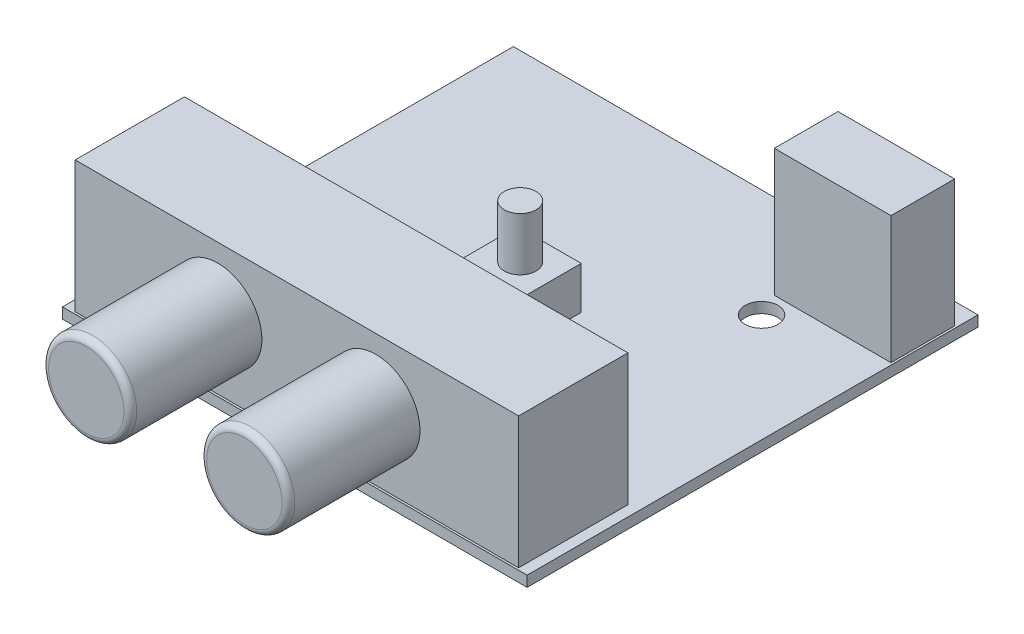
ISO-10303-21;
HEADER;
FILE_DESCRIPTION(('STEP AP214'),'2;1');
FILE_NAME('part.step','',(''),(''),'','','');
FILE_SCHEMA(('AUTOMOTIVE_DESIGN { 1 0 10303 214 1 1 1 1 }'));
ENDSEC;
DATA;
#1=APPLICATION_CONTEXT('core data for automotive mechanical design processes');
#2=APPLICATION_PROTOCOL_DEFINITION('international standard','automotive_design',2000,#1);
#3=PRODUCT_CONTEXT('',#1,'mechanical');
#4=PRODUCT('Part','Part','',(#3));
#5=PRODUCT_RELATED_PRODUCT_CATEGORY('part','',(#4));
#6=PRODUCT_DEFINITION_FORMATION('','',#4);
#7=PRODUCT_DEFINITION_CONTEXT('part definition',#1,'design');
#8=PRODUCT_DEFINITION('design','',#6,#7);
#9=PRODUCT_DEFINITION_SHAPE('','',#8);
#10=(LENGTH_UNIT() NAMED_UNIT(*) SI_UNIT(.MILLI.,.METRE.));
#11=(NAMED_UNIT(*) PLANE_ANGLE_UNIT() SI_UNIT($,.RADIAN.));
#12=(NAMED_UNIT(*) SI_UNIT($,.STERADIAN.) SOLID_ANGLE_UNIT());
#13=UNCERTAINTY_MEASURE_WITH_UNIT(LENGTH_MEASURE(1.E-05),#10,'distance_accuracy_value','');
#14=(GEOMETRIC_REPRESENTATION_CONTEXT(3) GLOBAL_UNCERTAINTY_ASSIGNED_CONTEXT((#13)) GLOBAL_UNIT_ASSIGNED_CONTEXT((#10,
#11,#12)) REPRESENTATION_CONTEXT('',''));
#15=CARTESIAN_POINT('',(0.,0.,0.));
#16=DIRECTION('',(0.,0.,1.));
#17=DIRECTION('',(1.,0.,0.));
#18=AXIS2_PLACEMENT_3D('',#15,#16,#17);
#19=CARTESIAN_POINT('',(0.,1.,0.));
#20=DIRECTION('',(0.,1.,0.));
#21=DIRECTION('',(0.,0.,1.));
#22=AXIS2_PLACEMENT_3D('',#19,#20,#21);
#23=PLANE('',#22);
#24=CARTESIAN_POINT('',(11.7,1.,-11.05));
#25=DIRECTION('',(0.,1.,0.));
#26=DIRECTION('',(0.,0.,1.));
#27=AXIS2_PLACEMENT_3D('',#24,#25,#26);
#28=CIRCLE('',#27,1.55);
#29=CARTESIAN_POINT('',(11.7,1.,-9.5));
#30=VERTEX_POINT('',#29);
#31=EDGE_CURVE('E364',#30,#30,#28,.T.);
#32=ORIENTED_EDGE('',*,*,#31,.F.);
#33=EDGE_LOOP('',(#32));
#34=FACE_BOUND('',#33,.T.);
#35=DIRECTION('',(0.,0.,1.));
#36=VECTOR('',#35,1.);
#37=CARTESIAN_POINT('',(-21.9,1.,21.25));
#38=LINE('',#37,#36);
#39=CARTESIAN_POINT('',(-21.9,1.,-21.25));
#40=VERTEX_POINT('',#39);
#41=CARTESIAN_POINT('',(-21.9,1.,21.25));
#42=VERTEX_POINT('',#41);
#43=EDGE_CURVE('E237',#40,#42,#38,.T.);
#44=ORIENTED_EDGE('',*,*,#43,.T.);
#45=DIRECTION('',(1.,0.,0.));
#46=VECTOR('',#45,1.);
#47=CARTESIAN_POINT('',(21.9,1.,21.25));
#48=LINE('',#47,#46);
#49=CARTESIAN_POINT('',(21.9,1.,21.25));
#50=VERTEX_POINT('',#49);
#51=EDGE_CURVE('E240',#42,#50,#48,.T.);
#52=ORIENTED_EDGE('',*,*,#51,.T.);
#53=DIRECTION('',(0.,0.,-1.));
#54=VECTOR('',#53,1.);
#55=CARTESIAN_POINT('',(21.9,1.,21.25));
#56=LINE('',#55,#54);
#57=CARTESIAN_POINT('',(21.9,1.,-21.25));
#58=VERTEX_POINT('',#57);
#59=EDGE_CURVE('E243',#50,#58,#56,.T.);
#60=ORIENTED_EDGE('',*,*,#59,.T.);
#61=DIRECTION('',(-1.,0.,0.));
#62=VECTOR('',#61,1.);
#63=CARTESIAN_POINT('',(21.9,1.,-21.25));
#64=LINE('',#63,#62);
#65=EDGE_CURVE('E245',#58,#40,#64,.T.);
#66=ORIENTED_EDGE('',*,*,#65,.T.);
#67=EDGE_LOOP('',(#44,#52,#60,#66));
#68=FACE_BOUND('',#67,.T.);
#69=DIRECTION('',(1.,0.,0.));
#70=VECTOR('',#69,1.);
#71=CARTESIAN_POINT('',(-20.9,1.,21.05));
#72=LINE('',#71,#70);
#73=CARTESIAN_POINT('',(-20.9,1.,21.05));
#74=VERTEX_POINT('',#73);
#75=CARTESIAN_POINT('',(20.9,1.,21.05));
#76=VERTEX_POINT('',#75);
#77=EDGE_CURVE('E221',#74,#76,#72,.T.);
#78=ORIENTED_EDGE('',*,*,#77,.F.);
#79=DIRECTION('',(0.,0.,1.));
#80=VECTOR('',#79,1.);
#81=CARTESIAN_POINT('',(-20.9,1.,10.75));
#82=LINE('',#81,#80);
#83=CARTESIAN_POINT('',(-20.9,1.,10.75));
#84=VERTEX_POINT('',#83);
#85=EDGE_CURVE('E207',#84,#74,#82,.T.);
#86=ORIENTED_EDGE('',*,*,#85,.F.);
#87=DIRECTION('',(-1.,0.,0.));
#88=VECTOR('',#87,1.);
#89=CARTESIAN_POINT('',(-20.9,1.,10.75));
#90=LINE('',#89,#88);
#91=CARTESIAN_POINT('',(20.9,1.,10.75));
#92=VERTEX_POINT('',#91);
#93=EDGE_CURVE('E212',#92,#84,#90,.T.);
#94=ORIENTED_EDGE('',*,*,#93,.F.);
#95=DIRECTION('',(0.,0.,-1.));
#96=VECTOR('',#95,1.);
#97=CARTESIAN_POINT('',(20.9,1.,10.75));
#98=LINE('',#97,#96);
#99=EDGE_CURVE('E223',#76,#92,#98,.T.);
#100=ORIENTED_EDGE('',*,*,#99,.F.);
#101=EDGE_LOOP('',(#78,#86,#94,#100));
#102=FACE_BOUND('',#101,.T.);
#103=DIRECTION('',(1.,0.,0.));
#104=VECTOR('',#103,1.);
#105=CARTESIAN_POINT('',(10.7,1.,-13.25));
#106=LINE('',#105,#104);
#107=CARTESIAN_POINT('',(10.7,1.,-13.25));
#108=VERTEX_POINT('',#107);
#109=CARTESIAN_POINT('',(21.7,1.,-13.25));
#110=VERTEX_POINT('',#109);
#111=EDGE_CURVE('E179',#108,#110,#106,.T.);
#112=ORIENTED_EDGE('',*,*,#111,.F.);
#113=DIRECTION('',(0.,0.,1.));
#114=VECTOR('',#113,1.);
#115=CARTESIAN_POINT('',(10.7,1.,-13.25));
#116=LINE('',#115,#114);
#117=CARTESIAN_POINT('',(10.7,1.,-19.25));
#118=VERTEX_POINT('',#117);
#119=EDGE_CURVE('E176',#118,#108,#116,.T.);
#120=ORIENTED_EDGE('',*,*,#119,.F.);
#121=DIRECTION('',(-1.,0.,0.));
#122=VECTOR('',#121,1.);
#123=CARTESIAN_POINT('',(10.7,1.,-19.25));
#124=LINE('',#123,#122);
#125=CARTESIAN_POINT('',(21.7,1.,-19.25));
#126=VERTEX_POINT('',#125);
#127=EDGE_CURVE('E188',#126,#118,#124,.T.);
#128=ORIENTED_EDGE('',*,*,#127,.F.);
#129=DIRECTION('',(0.,0.,-1.));
#130=VECTOR('',#129,1.);
#131=CARTESIAN_POINT('',(21.7,1.,-13.25));
#132=LINE('',#131,#130);
#133=EDGE_CURVE('E196',#110,#126,#132,.T.);
#134=ORIENTED_EDGE('',*,*,#133,.F.);
#135=EDGE_LOOP('',(#112,#120,#128,#134));
#136=FACE_BOUND('',#135,.T.);
#137=DIRECTION('',(1.,0.,0.));
#138=VECTOR('',#137,1.);
#139=CARTESIAN_POINT('',(-3.,1.,3.25));
#140=LINE('',#139,#138);
#141=CARTESIAN_POINT('',(-3.,1.,3.25));
#142=VERTEX_POINT('',#141);
#143=CARTESIAN_POINT('',(3.,1.,3.25));
#144=VERTEX_POINT('',#143);
#145=EDGE_CURVE('E346',#142,#144,#140,.T.);
#146=ORIENTED_EDGE('',*,*,#145,.F.);
#147=DIRECTION('',(0.,0.,1.));
#148=VECTOR('',#147,1.);
#149=CARTESIAN_POINT('',(-3.,1.,-2.75));
#150=LINE('',#149,#148);
#151=CARTESIAN_POINT('',(-3.,1.,-2.75));
#152=VERTEX_POINT('',#151);
#153=EDGE_CURVE('E174',#152,#142,#150,.T.);
#154=ORIENTED_EDGE('',*,*,#153,.F.);
#155=DIRECTION('',(-1.,0.,0.));
#156=VECTOR('',#155,1.);
#157=CARTESIAN_POINT('',(-3.,1.,-2.75));
#158=LINE('',#157,#156);
#159=CARTESIAN_POINT('',(3.,1.,-2.75));
#160=VERTEX_POINT('',#159);
#161=EDGE_CURVE('E170',#160,#152,#158,.T.);
#162=ORIENTED_EDGE('',*,*,#161,.F.);
#163=DIRECTION('',(0.,0.,-1.));
#164=VECTOR('',#163,1.);
#165=CARTESIAN_POINT('',(3.,1.,-2.75));
#166=LINE('',#165,#164);
#167=EDGE_CURVE('E348',#144,#160,#166,.T.);
#168=ORIENTED_EDGE('',*,*,#167,.F.);
#169=EDGE_LOOP('',(#146,#154,#162,#168));
#170=FACE_BOUND('',#169,.T.);
#171=ADVANCED_FACE('F37',(#34,#68,#102,#136,#170),#23,.T.);
#172=CARTESIAN_POINT('',(-21.9,1.,21.25));
#173=DIRECTION('',(1.,0.,0.));
#174=DIRECTION('',(0.,0.,-1.));
#175=AXIS2_PLACEMENT_3D('',#172,#173,#174);
#176=PLANE('',#175);
#177=DIRECTION('',(0.,0.,1.));
#178=VECTOR('',#177,1.);
#179=CARTESIAN_POINT('',(-21.9,0.,21.25));
#180=LINE('',#179,#178);
#181=CARTESIAN_POINT('',(-21.9,0.,-21.25));
#182=VERTEX_POINT('',#181);
#183=CARTESIAN_POINT('',(-21.9,0.,21.25));
#184=VERTEX_POINT('',#183);
#185=EDGE_CURVE('E236',#182,#184,#180,.T.);
#186=ORIENTED_EDGE('',*,*,#185,.T.);
#187=DIRECTION('',(0.,-1.,0.));
#188=VECTOR('',#187,1.);
#189=CARTESIAN_POINT('',(-21.9,1.,21.25));
#190=LINE('',#189,#188);
#191=EDGE_CURVE('E263',#42,#184,#190,.T.);
#192=ORIENTED_EDGE('',*,*,#191,.F.);
#193=ORIENTED_EDGE('',*,*,#43,.F.);
#194=DIRECTION('',(0.,-1.,0.));
#195=VECTOR('',#194,1.);
#196=CARTESIAN_POINT('',(-21.9,1.,-21.25));
#197=LINE('',#196,#195);
#198=EDGE_CURVE('E247',#40,#182,#197,.T.);
#199=ORIENTED_EDGE('',*,*,#198,.T.);
#200=EDGE_LOOP('',(#186,#192,#193,#199));
#201=FACE_BOUND('',#200,.T.);
#202=ADVANCED_FACE('F293',(#201),#176,.F.);
#203=CARTESIAN_POINT('',(21.9,1.,21.25));
#204=DIRECTION('',(0.,0.,-1.));
#205=DIRECTION('',(-1.,0.,0.));
#206=AXIS2_PLACEMENT_3D('',#203,#204,#205);
#207=PLANE('',#206);
#208=DIRECTION('',(1.,0.,0.));
#209=VECTOR('',#208,1.);
#210=CARTESIAN_POINT('',(21.9,0.,21.25));
#211=LINE('',#210,#209);
#212=CARTESIAN_POINT('',(21.9,0.,21.25));
#213=VERTEX_POINT('',#212);
#214=EDGE_CURVE('E250',#184,#213,#211,.T.);
#215=ORIENTED_EDGE('',*,*,#214,.T.);
#216=DIRECTION('',(0.,-1.,0.));
#217=VECTOR('',#216,1.);
#218=CARTESIAN_POINT('',(21.9,1.,21.25));
#219=LINE('',#218,#217);
#220=EDGE_CURVE('E260',#50,#213,#219,.T.);
#221=ORIENTED_EDGE('',*,*,#220,.F.);
#222=ORIENTED_EDGE('',*,*,#51,.F.);
#223=ORIENTED_EDGE('',*,*,#191,.T.);
#224=EDGE_LOOP('',(#215,#221,#222,#223));
#225=FACE_BOUND('',#224,.T.);
#226=ADVANCED_FACE('F301',(#225),#207,.F.);
#227=CARTESIAN_POINT('',(21.9,1.,21.25));
#228=DIRECTION('',(-1.,0.,0.));
#229=DIRECTION('',(0.,0.,1.));
#230=AXIS2_PLACEMENT_3D('',#227,#228,#229);
#231=PLANE('',#230);
#232=DIRECTION('',(0.,0.,-1.));
#233=VECTOR('',#232,1.);
#234=CARTESIAN_POINT('',(21.9,0.,21.25));
#235=LINE('',#234,#233);
#236=CARTESIAN_POINT('',(21.9,0.,-21.25));
#237=VERTEX_POINT('',#236);
#238=EDGE_CURVE('E252',#213,#237,#235,.T.);
#239=ORIENTED_EDGE('',*,*,#238,.T.);
#240=DIRECTION('',(0.,-1.,0.));
#241=VECTOR('',#240,1.);
#242=CARTESIAN_POINT('',(21.9,1.,-21.25));
#243=LINE('',#242,#241);
#244=EDGE_CURVE('E257',#58,#237,#243,.T.);
#245=ORIENTED_EDGE('',*,*,#244,.F.);
#246=ORIENTED_EDGE('',*,*,#59,.F.);
#247=ORIENTED_EDGE('',*,*,#220,.T.);
#248=EDGE_LOOP('',(#239,#245,#246,#247));
#249=FACE_BOUND('',#248,.T.);
#250=ADVANCED_FACE('F316',(#249),#231,.F.);
#251=CARTESIAN_POINT('',(21.9,1.,-21.25));
#252=DIRECTION('',(0.,0.,1.));
#253=DIRECTION('',(1.,0.,0.));
#254=AXIS2_PLACEMENT_3D('',#251,#252,#253);
#255=PLANE('',#254);
#256=DIRECTION('',(-1.,0.,0.));
#257=VECTOR('',#256,1.);
#258=CARTESIAN_POINT('',(21.9,0.,-21.25));
#259=LINE('',#258,#257);
#260=EDGE_CURVE('E241',#237,#182,#259,.T.);
#261=ORIENTED_EDGE('',*,*,#260,.T.);
#262=ORIENTED_EDGE('',*,*,#198,.F.);
#263=ORIENTED_EDGE('',*,*,#65,.F.);
#264=ORIENTED_EDGE('',*,*,#244,.T.);
#265=EDGE_LOOP('',(#261,#262,#263,#264));
#266=FACE_BOUND('',#265,.T.);
#267=ADVANCED_FACE('F312',(#266),#255,.F.);
#268=CARTESIAN_POINT('',(0.,0.,0.));
#269=DIRECTION('',(0.,1.,0.));
#270=DIRECTION('',(0.,0.,1.));
#271=AXIS2_PLACEMENT_3D('',#268,#269,#270);
#272=PLANE('',#271);
#273=CARTESIAN_POINT('',(11.7,0.,-11.05));
#274=DIRECTION('',(0.,1.,0.));
#275=DIRECTION('',(0.,0.,1.));
#276=AXIS2_PLACEMENT_3D('',#273,#274,#275);
#277=CIRCLE('',#276,1.55);
#278=CARTESIAN_POINT('',(11.7,0.,-9.5));
#279=VERTEX_POINT('',#278);
#280=EDGE_CURVE('E361',#279,#279,#277,.T.);
#281=ORIENTED_EDGE('',*,*,#280,.T.);
#282=EDGE_LOOP('',(#281));
#283=FACE_BOUND('',#282,.T.);
#284=ORIENTED_EDGE('',*,*,#185,.F.);
#285=ORIENTED_EDGE('',*,*,#260,.F.);
#286=ORIENTED_EDGE('',*,*,#238,.F.);
#287=ORIENTED_EDGE('',*,*,#214,.F.);
#288=EDGE_LOOP('',(#284,#285,#286,#287));
#289=FACE_BOUND('',#288,.T.);
#290=ADVANCED_FACE('F310',(#283,#289),#272,.F.);
#291=CARTESIAN_POINT('',(-20.9,13.4,10.75));
#292=DIRECTION('',(1.,0.,0.));
#293=DIRECTION('',(0.,0.,-1.));
#294=AXIS2_PLACEMENT_3D('',#291,#292,#293);
#295=PLANE('',#294);
#296=ORIENTED_EDGE('',*,*,#85,.T.);
#297=DIRECTION('',(0.,-1.,0.));
#298=VECTOR('',#297,1.);
#299=CARTESIAN_POINT('',(-20.9,13.4,21.05));
#300=LINE('',#299,#298);
#301=CARTESIAN_POINT('',(-20.9,13.4,21.05));
#302=VERTEX_POINT('',#301);
#303=EDGE_CURVE('E234',#302,#74,#300,.T.);
#304=ORIENTED_EDGE('',*,*,#303,.F.);
#305=DIRECTION('',(0.,0.,1.));
#306=VECTOR('',#305,1.);
#307=CARTESIAN_POINT('',(-20.9,13.4,10.75));
#308=LINE('',#307,#306);
#309=CARTESIAN_POINT('',(-20.9,13.4,10.75));
#310=VERTEX_POINT('',#309);
#311=EDGE_CURVE('E208',#310,#302,#308,.T.);
#312=ORIENTED_EDGE('',*,*,#311,.F.);
#313=DIRECTION('',(0.,-1.,0.));
#314=VECTOR('',#313,1.);
#315=CARTESIAN_POINT('',(-20.9,13.4,10.75));
#316=LINE('',#315,#314);
#317=EDGE_CURVE('E218',#310,#84,#316,.T.);
#318=ORIENTED_EDGE('',*,*,#317,.T.);
#319=EDGE_LOOP('',(#296,#304,#312,#318));
#320=FACE_BOUND('',#319,.T.);
#321=ADVANCED_FACE('F308',(#320),#295,.F.);
#322=CARTESIAN_POINT('',(-20.9,13.4,21.05));
#323=DIRECTION('',(0.,0.,-1.));
#324=DIRECTION('',(-1.,0.,0.));
#325=AXIS2_PLACEMENT_3D('',#322,#323,#324);
#326=PLANE('',#325);
#327=CARTESIAN_POINT('',(-7.45,7.55,21.05));
#328=DIRECTION('',(0.,0.,-1.));
#329=DIRECTION('',(-1.,0.,0.));
#330=AXIS2_PLACEMENT_3D('',#327,#328,#329);
#331=CIRCLE('',#330,4.15);
#332=CARTESIAN_POINT('',(-11.6,7.55,21.05));
#333=VERTEX_POINT('',#332);
#334=EDGE_CURVE('E269',#333,#333,#331,.F.);
#335=ORIENTED_EDGE('',*,*,#334,.F.);
#336=EDGE_LOOP('',(#335));
#337=FACE_BOUND('',#336,.T.);
#338=CARTESIAN_POINT('',(7.45,7.55,21.05));
#339=DIRECTION('',(0.,0.,-1.));
#340=DIRECTION('',(-1.,0.,0.));
#341=AXIS2_PLACEMENT_3D('',#338,#339,#340);
#342=CIRCLE('',#341,4.15);
#343=CARTESIAN_POINT('',(3.3,7.55,21.05));
#344=VERTEX_POINT('',#343);
#345=EDGE_CURVE('E266',#344,#344,#342,.F.);
#346=ORIENTED_EDGE('',*,*,#345,.F.);
#347=EDGE_LOOP('',(#346));
#348=FACE_BOUND('',#347,.T.);
#349=ORIENTED_EDGE('',*,*,#77,.T.);
#350=DIRECTION('',(0.,-1.,0.));
#351=VECTOR('',#350,1.);
#352=CARTESIAN_POINT('',(20.9,13.4,21.05));
#353=LINE('',#352,#351);
#354=CARTESIAN_POINT('',(20.9,13.4,21.05));
#355=VERTEX_POINT('',#354);
#356=EDGE_CURVE('E231',#355,#76,#353,.T.);
#357=ORIENTED_EDGE('',*,*,#356,.F.);
#358=DIRECTION('',(1.,0.,0.));
#359=VECTOR('',#358,1.);
#360=CARTESIAN_POINT('',(-20.9,13.4,21.05));
#361=LINE('',#360,#359);
#362=EDGE_CURVE('E211',#302,#355,#361,.T.);
#363=ORIENTED_EDGE('',*,*,#362,.F.);
#364=ORIENTED_EDGE('',*,*,#303,.T.);
#365=EDGE_LOOP('',(#349,#357,#363,#364));
#366=FACE_BOUND('',#365,.T.);
#367=ADVANCED_FACE('F441',(#337,#348,#366),#326,.F.);
#368=CARTESIAN_POINT('',(20.9,13.4,10.75));
#369=DIRECTION('',(-1.,0.,0.));
#370=DIRECTION('',(0.,0.,1.));
#371=AXIS2_PLACEMENT_3D('',#368,#369,#370);
#372=PLANE('',#371);
#373=ORIENTED_EDGE('',*,*,#99,.T.);
#374=DIRECTION('',(0.,-1.,0.));
#375=VECTOR('',#374,1.);
#376=CARTESIAN_POINT('',(20.9,13.4,10.75));
#377=LINE('',#376,#375);
#378=CARTESIAN_POINT('',(20.9,13.4,10.75));
#379=VERTEX_POINT('',#378);
#380=EDGE_CURVE('E229',#379,#92,#377,.T.);
#381=ORIENTED_EDGE('',*,*,#380,.F.);
#382=DIRECTION('',(0.,0.,-1.));
#383=VECTOR('',#382,1.);
#384=CARTESIAN_POINT('',(20.9,13.4,10.75));
#385=LINE('',#384,#383);
#386=EDGE_CURVE('E214',#355,#379,#385,.T.);
#387=ORIENTED_EDGE('',*,*,#386,.F.);
#388=ORIENTED_EDGE('',*,*,#356,.T.);
#389=EDGE_LOOP('',(#373,#381,#387,#388));
#390=FACE_BOUND('',#389,.T.);
#391=ADVANCED_FACE('F438',(#390),#372,.F.);
#392=CARTESIAN_POINT('',(-20.9,13.4,10.75));
#393=DIRECTION('',(0.,0.,1.));
#394=DIRECTION('',(1.,0.,0.));
#395=AXIS2_PLACEMENT_3D('',#392,#393,#394);
#396=PLANE('',#395);
#397=ORIENTED_EDGE('',*,*,#93,.T.);
#398=ORIENTED_EDGE('',*,*,#317,.F.);
#399=DIRECTION('',(-1.,0.,0.));
#400=VECTOR('',#399,1.);
#401=CARTESIAN_POINT('',(-20.9,13.4,10.75));
#402=LINE('',#401,#400);
#403=EDGE_CURVE('E216',#379,#310,#402,.T.);
#404=ORIENTED_EDGE('',*,*,#403,.F.);
#405=ORIENTED_EDGE('',*,*,#380,.T.);
#406=EDGE_LOOP('',(#397,#398,#404,#405));
#407=FACE_BOUND('',#406,.T.);
#408=ADVANCED_FACE('F434',(#407),#396,.F.);
#409=CARTESIAN_POINT('',(0.,13.4,0.));
#410=DIRECTION('',(0.,1.,0.));
#411=DIRECTION('',(0.,0.,1.));
#412=AXIS2_PLACEMENT_3D('',#409,#410,#411);
#413=PLANE('',#412);
#414=ORIENTED_EDGE('',*,*,#311,.T.);
#415=ORIENTED_EDGE('',*,*,#362,.T.);
#416=ORIENTED_EDGE('',*,*,#386,.T.);
#417=ORIENTED_EDGE('',*,*,#403,.T.);
#418=EDGE_LOOP('',(#414,#415,#416,#417));
#419=FACE_BOUND('',#418,.T.);
#420=ADVANCED_FACE('F430',(#419),#413,.T.);
#421=CARTESIAN_POINT('',(7.45,7.55,33.45));
#422=DIRECTION('',(0.,0.,-1.));
#423=DIRECTION('',(-1.,0.,0.));
#424=AXIS2_PLACEMENT_3D('',#421,#422,#423);
#425=CYLINDRICAL_SURFACE('',#424,4.15);
#426=CARTESIAN_POINT('',(7.45,7.55,32.85));
#427=DIRECTION('',(0.,0.,1.));
#428=DIRECTION('',(1.,0.,0.));
#429=AXIS2_PLACEMENT_3D('',#426,#427,#428);
#430=CIRCLE('',#429,4.15);
#431=CARTESIAN_POINT('',(11.6,7.55,32.85));
#432=VERTEX_POINT('',#431);
#433=EDGE_CURVE('E276',#432,#432,#430,.F.);
#434=ORIENTED_EDGE('',*,*,#433,.T.);
#435=EDGE_LOOP('',(#434));
#436=FACE_BOUND('',#435,.T.);
#437=ORIENTED_EDGE('',*,*,#345,.T.);
#438=EDGE_LOOP('',(#437));
#439=FACE_BOUND('',#438,.T.);
#440=ADVANCED_FACE('F426',(#436,#439),#425,.T.);
#441=CARTESIAN_POINT('',(7.45,7.55,33.45));
#442=DIRECTION('',(0.,0.,1.));
#443=DIRECTION('',(1.,0.,0.));
#444=AXIS2_PLACEMENT_3D('',#441,#442,#443);
#445=PLANE('',#444);
#446=CARTESIAN_POINT('',(7.45,7.55,33.45));
#447=DIRECTION('',(0.,0.,1.));
#448=DIRECTION('',(1.,0.,0.));
#449=AXIS2_PLACEMENT_3D('',#446,#447,#448);
#450=CIRCLE('',#449,3.55);
#451=CARTESIAN_POINT('',(11.,7.55,33.45));
#452=VERTEX_POINT('',#451);
#453=EDGE_CURVE('E273',#452,#452,#450,.T.);
#454=ORIENTED_EDGE('',*,*,#453,.T.);
#455=EDGE_LOOP('',(#454));
#456=FACE_BOUND('',#455,.T.);
#457=ADVANCED_FACE('F422',(#456),#445,.T.);
#458=CARTESIAN_POINT('',(-7.45,7.55,33.45));
#459=DIRECTION('',(0.,0.,-1.));
#460=DIRECTION('',(-1.,0.,0.));
#461=AXIS2_PLACEMENT_3D('',#458,#459,#460);
#462=CYLINDRICAL_SURFACE('',#461,4.15);
#463=CARTESIAN_POINT('',(-7.45,7.55,32.85));
#464=DIRECTION('',(0.,0.,1.));
#465=DIRECTION('',(1.,0.,0.));
#466=AXIS2_PLACEMENT_3D('',#463,#464,#465);
#467=CIRCLE('',#466,4.15);
#468=CARTESIAN_POINT('',(-3.3,7.55,32.85));
#469=VERTEX_POINT('',#468);
#470=EDGE_CURVE('E12',#469,#469,#467,.F.);
#471=ORIENTED_EDGE('',*,*,#470,.T.);
#472=EDGE_LOOP('',(#471));
#473=FACE_BOUND('',#472,.T.);
#474=ORIENTED_EDGE('',*,*,#334,.T.);
#475=EDGE_LOOP('',(#474));
#476=FACE_BOUND('',#475,.T.);
#477=ADVANCED_FACE('F419',(#473,#476),#462,.T.);
#478=CARTESIAN_POINT('',(-7.45,7.55,33.45));
#479=DIRECTION('',(0.,0.,1.));
#480=DIRECTION('',(1.,0.,0.));
#481=AXIS2_PLACEMENT_3D('',#478,#479,#480);
#482=PLANE('',#481);
#483=CARTESIAN_POINT('',(-7.45,7.55,33.45));
#484=DIRECTION('',(0.,0.,1.));
#485=DIRECTION('',(1.,0.,0.));
#486=AXIS2_PLACEMENT_3D('',#483,#484,#485);
#487=CIRCLE('',#486,3.55);
#488=CARTESIAN_POINT('',(-3.9,7.55,33.45));
#489=VERTEX_POINT('',#488);
#490=EDGE_CURVE('E45',#489,#489,#487,.T.);
#491=ORIENTED_EDGE('',*,*,#490,.T.);
#492=EDGE_LOOP('',(#491));
#493=FACE_BOUND('',#492,.T.);
#494=ADVANCED_FACE('F281',(#493),#482,.T.);
#495=CARTESIAN_POINT('',(10.7,13.,-13.25));
#496=DIRECTION('',(1.,0.,0.));
#497=DIRECTION('',(0.,0.,-1.));
#498=AXIS2_PLACEMENT_3D('',#495,#496,#497);
#499=PLANE('',#498);
#500=ORIENTED_EDGE('',*,*,#119,.T.);
#501=DIRECTION('',(0.,-1.,0.));
#502=VECTOR('',#501,1.);
#503=CARTESIAN_POINT('',(10.7,13.,-13.25));
#504=LINE('',#503,#502);
#505=CARTESIAN_POINT('',(10.7,13.,-13.25));
#506=VERTEX_POINT('',#505);
#507=EDGE_CURVE('E205',#506,#108,#504,.T.);
#508=ORIENTED_EDGE('',*,*,#507,.F.);
#509=DIRECTION('',(0.,0.,1.));
#510=VECTOR('',#509,1.);
#511=CARTESIAN_POINT('',(10.7,13.,-13.25));
#512=LINE('',#511,#510);
#513=CARTESIAN_POINT('',(10.7,13.,-19.25));
#514=VERTEX_POINT('',#513);
#515=EDGE_CURVE('E184',#514,#506,#512,.T.);
#516=ORIENTED_EDGE('',*,*,#515,.F.);
#517=DIRECTION('',(0.,-1.,0.));
#518=VECTOR('',#517,1.);
#519=CARTESIAN_POINT('',(10.7,13.,-19.25));
#520=LINE('',#519,#518);
#521=EDGE_CURVE('E193',#514,#118,#520,.T.);
#522=ORIENTED_EDGE('',*,*,#521,.T.);
#523=EDGE_LOOP('',(#500,#508,#516,#522));
#524=FACE_BOUND('',#523,.T.);
#525=ADVANCED_FACE('F412',(#524),#499,.F.);
#526=CARTESIAN_POINT('',(10.7,13.,-13.25));
#527=DIRECTION('',(0.,0.,-1.));
#528=DIRECTION('',(-1.,0.,0.));
#529=AXIS2_PLACEMENT_3D('',#526,#527,#528);
#530=PLANE('',#529);
#531=ORIENTED_EDGE('',*,*,#111,.T.);
#532=DIRECTION('',(0.,-1.,0.));
#533=VECTOR('',#532,1.);
#534=CARTESIAN_POINT('',(21.7,13.,-13.25));
#535=LINE('',#534,#533);
#536=CARTESIAN_POINT('',(21.7,13.,-13.25));
#537=VERTEX_POINT('',#536);
#538=EDGE_CURVE('E202',#537,#110,#535,.T.);
#539=ORIENTED_EDGE('',*,*,#538,.F.);
#540=DIRECTION('',(1.,0.,0.));
#541=VECTOR('',#540,1.);
#542=CARTESIAN_POINT('',(10.7,13.,-13.25));
#543=LINE('',#542,#541);
#544=EDGE_CURVE('E187',#506,#537,#543,.T.);
#545=ORIENTED_EDGE('',*,*,#544,.F.);
#546=ORIENTED_EDGE('',*,*,#507,.T.);
#547=EDGE_LOOP('',(#531,#539,#545,#546));
#548=FACE_BOUND('',#547,.T.);
#549=ADVANCED_FACE('F408',(#548),#530,.F.);
#550=CARTESIAN_POINT('',(21.7,13.,-13.25));
#551=DIRECTION('',(-1.,0.,0.));
#552=DIRECTION('',(0.,0.,1.));
#553=AXIS2_PLACEMENT_3D('',#550,#551,#552);
#554=PLANE('',#553);
#555=ORIENTED_EDGE('',*,*,#133,.T.);
#556=DIRECTION('',(0.,-1.,0.));
#557=VECTOR('',#556,1.);
#558=CARTESIAN_POINT('',(21.7,13.,-19.25));
#559=LINE('',#558,#557);
#560=CARTESIAN_POINT('',(21.7,13.,-19.25));
#561=VERTEX_POINT('',#560);
#562=EDGE_CURVE('E60',#561,#126,#559,.T.);
#563=ORIENTED_EDGE('',*,*,#562,.F.);
#564=DIRECTION('',(0.,0.,-1.));
#565=VECTOR('',#564,1.);
#566=CARTESIAN_POINT('',(21.7,13.,-13.25));
#567=LINE('',#566,#565);
#568=EDGE_CURVE('E190',#537,#561,#567,.T.);
#569=ORIENTED_EDGE('',*,*,#568,.F.);
#570=ORIENTED_EDGE('',*,*,#538,.T.);
#571=EDGE_LOOP('',(#555,#563,#569,#570));
#572=FACE_BOUND('',#571,.T.);
#573=ADVANCED_FACE('F405',(#572),#554,.F.);
#574=CARTESIAN_POINT('',(10.7,13.,-19.25));
#575=DIRECTION('',(0.,0.,1.));
#576=DIRECTION('',(1.,0.,0.));
#577=AXIS2_PLACEMENT_3D('',#574,#575,#576);
#578=PLANE('',#577);
#579=ORIENTED_EDGE('',*,*,#127,.T.);
#580=ORIENTED_EDGE('',*,*,#521,.F.);
#581=DIRECTION('',(-1.,0.,0.));
#582=VECTOR('',#581,1.);
#583=CARTESIAN_POINT('',(10.7,13.,-19.25));
#584=LINE('',#583,#582);
#585=EDGE_CURVE('E192',#561,#514,#584,.T.);
#586=ORIENTED_EDGE('',*,*,#585,.F.);
#587=ORIENTED_EDGE('',*,*,#562,.T.);
#588=EDGE_LOOP('',(#579,#580,#586,#587));
#589=FACE_BOUND('',#588,.T.);
#590=ADVANCED_FACE('F401',(#589),#578,.F.);
#591=CARTESIAN_POINT('',(0.,13.,0.));
#592=DIRECTION('',(0.,-1.,0.));
#593=DIRECTION('',(0.,0.,-1.));
#594=AXIS2_PLACEMENT_3D('',#591,#592,#593);
#595=PLANE('',#594);
#596=ORIENTED_EDGE('',*,*,#515,.T.);
#597=ORIENTED_EDGE('',*,*,#544,.T.);
#598=ORIENTED_EDGE('',*,*,#568,.T.);
#599=ORIENTED_EDGE('',*,*,#585,.T.);
#600=EDGE_LOOP('',(#596,#597,#598,#599));
#601=FACE_BOUND('',#600,.T.);
#602=ADVANCED_FACE('F398',(#601),#595,.F.);
#603=CARTESIAN_POINT('',(-3.,5.,-2.75));
#604=DIRECTION('',(1.,0.,0.));
#605=DIRECTION('',(0.,0.,-1.));
#606=AXIS2_PLACEMENT_3D('',#603,#604,#605);
#607=PLANE('',#606);
#608=ORIENTED_EDGE('',*,*,#153,.T.);
#609=DIRECTION('',(0.,-1.,0.));
#610=VECTOR('',#609,1.);
#611=CARTESIAN_POINT('',(-3.,5.,3.25));
#612=LINE('',#611,#610);
#613=CARTESIAN_POINT('',(-3.,5.,3.25));
#614=VERTEX_POINT('',#613);
#615=EDGE_CURVE('E155',#614,#142,#612,.T.);
#616=ORIENTED_EDGE('',*,*,#615,.F.);
#617=DIRECTION('',(0.,0.,1.));
#618=VECTOR('',#617,1.);
#619=CARTESIAN_POINT('',(-3.,5.,-2.75));
#620=LINE('',#619,#618);
#621=CARTESIAN_POINT('',(-3.,5.,-2.75));
#622=VERTEX_POINT('',#621);
#623=EDGE_CURVE('E162',#622,#614,#620,.T.);
#624=ORIENTED_EDGE('',*,*,#623,.F.);
#625=DIRECTION('',(0.,-1.,0.));
#626=VECTOR('',#625,1.);
#627=CARTESIAN_POINT('',(-3.,5.,-2.75));
#628=LINE('',#627,#626);
#629=EDGE_CURVE('E356',#622,#152,#628,.T.);
#630=ORIENTED_EDGE('',*,*,#629,.T.);
#631=EDGE_LOOP('',(#608,#616,#624,#630));
#632=FACE_BOUND('',#631,.T.);
#633=ADVANCED_FACE('F172',(#632),#607,.F.);
#634=CARTESIAN_POINT('',(-3.,5.,3.25));
#635=DIRECTION('',(0.,0.,-1.));
#636=DIRECTION('',(-1.,0.,0.));
#637=AXIS2_PLACEMENT_3D('',#634,#635,#636);
#638=PLANE('',#637);
#639=ORIENTED_EDGE('',*,*,#145,.T.);
#640=DIRECTION('',(0.,-1.,0.));
#641=VECTOR('',#640,1.);
#642=CARTESIAN_POINT('',(3.,5.,3.25));
#643=LINE('',#642,#641);
#644=CARTESIAN_POINT('',(3.,5.,3.25));
#645=VERTEX_POINT('',#644);
#646=EDGE_CURVE('E158',#645,#144,#643,.T.);
#647=ORIENTED_EDGE('',*,*,#646,.F.);
#648=DIRECTION('',(1.,0.,0.));
#649=VECTOR('',#648,1.);
#650=CARTESIAN_POINT('',(-3.,5.,3.25));
#651=LINE('',#650,#649);
#652=EDGE_CURVE('E151',#614,#645,#651,.T.);
#653=ORIENTED_EDGE('',*,*,#652,.F.);
#654=ORIENTED_EDGE('',*,*,#615,.T.);
#655=EDGE_LOOP('',(#639,#647,#653,#654));
#656=FACE_BOUND('',#655,.T.);
#657=ADVANCED_FACE('F153',(#656),#638,.F.);
#658=CARTESIAN_POINT('',(3.,5.,-2.75));
#659=DIRECTION('',(-1.,0.,0.));
#660=DIRECTION('',(0.,0.,1.));
#661=AXIS2_PLACEMENT_3D('',#658,#659,#660);
#662=PLANE('',#661);
#663=ORIENTED_EDGE('',*,*,#167,.T.);
#664=DIRECTION('',(0.,-1.,0.));
#665=VECTOR('',#664,1.);
#666=CARTESIAN_POINT('',(3.,5.,-2.75));
#667=LINE('',#666,#665);
#668=CARTESIAN_POINT('',(3.,5.,-2.75));
#669=VERTEX_POINT('',#668);
#670=EDGE_CURVE('E52',#669,#160,#667,.T.);
#671=ORIENTED_EDGE('',*,*,#670,.F.);
#672=DIRECTION('',(0.,0.,-1.));
#673=VECTOR('',#672,1.);
#674=CARTESIAN_POINT('',(3.,5.,-2.75));
#675=LINE('',#674,#673);
#676=EDGE_CURVE('E161',#645,#669,#675,.T.);
#677=ORIENTED_EDGE('',*,*,#676,.F.);
#678=ORIENTED_EDGE('',*,*,#646,.T.);
#679=EDGE_LOOP('',(#663,#671,#677,#678));
#680=FACE_BOUND('',#679,.T.);
#681=ADVANCED_FACE('F390',(#680),#662,.F.);
#682=CARTESIAN_POINT('',(-3.,5.,-2.75));
#683=DIRECTION('',(0.,0.,1.));
#684=DIRECTION('',(1.,0.,0.));
#685=AXIS2_PLACEMENT_3D('',#682,#683,#684);
#686=PLANE('',#685);
#687=ORIENTED_EDGE('',*,*,#161,.T.);
#688=ORIENTED_EDGE('',*,*,#629,.F.);
#689=DIRECTION('',(-1.,0.,0.));
#690=VECTOR('',#689,1.);
#691=CARTESIAN_POINT('',(-3.,5.,-2.75));
#692=LINE('',#691,#690);
#693=EDGE_CURVE('E166',#669,#622,#692,.T.);
#694=ORIENTED_EDGE('',*,*,#693,.F.);
#695=ORIENTED_EDGE('',*,*,#670,.T.);
#696=EDGE_LOOP('',(#687,#688,#694,#695));
#697=FACE_BOUND('',#696,.T.);
#698=ADVANCED_FACE('F386',(#697),#686,.F.);
#699=CARTESIAN_POINT('',(0.,5.,0.));
#700=DIRECTION('',(0.,1.,0.));
#701=DIRECTION('',(0.,0.,1.));
#702=AXIS2_PLACEMENT_3D('',#699,#700,#701);
#703=PLANE('',#702);
#704=CARTESIAN_POINT('',(0.,5.,0.));
#705=DIRECTION('',(0.,1.,0.));
#706=DIRECTION('',(0.,0.,1.));
#707=AXIS2_PLACEMENT_3D('',#704,#705,#706);
#708=CIRCLE('',#707,1.5);
#709=CARTESIAN_POINT('',(0.,5.,1.5));
#710=VERTEX_POINT('',#709);
#711=EDGE_CURVE('E272',#710,#710,#708,.T.);
#712=ORIENTED_EDGE('',*,*,#711,.F.);
#713=EDGE_LOOP('',(#712));
#714=FACE_BOUND('',#713,.T.);
#715=ORIENTED_EDGE('',*,*,#623,.T.);
#716=ORIENTED_EDGE('',*,*,#652,.T.);
#717=ORIENTED_EDGE('',*,*,#676,.T.);
#718=ORIENTED_EDGE('',*,*,#693,.T.);
#719=EDGE_LOOP('',(#715,#716,#717,#718));
#720=FACE_BOUND('',#719,.T.);
#721=ADVANCED_FACE('F165',(#714,#720),#703,.T.);
#722=CARTESIAN_POINT('',(0.,23.2426406871193,0.));
#723=DIRECTION('',(0.,-1.,0.));
#724=DIRECTION('',(0.,0.,-1.));
#725=AXIS2_PLACEMENT_3D('',#722,#723,#724);
#726=CYLINDRICAL_SURFACE('',#725,1.5);
#727=ORIENTED_EDGE('',*,*,#711,.T.);
#728=EDGE_LOOP('',(#727));
#729=FACE_BOUND('',#728,.T.);
#730=CARTESIAN_POINT('',(0.,10.,0.));
#731=DIRECTION('',(0.,1.,0.));
#732=DIRECTION('',(0.,0.,1.));
#733=AXIS2_PLACEMENT_3D('',#730,#731,#732);
#734=CIRCLE('',#733,1.5);
#735=CARTESIAN_POINT('',(0.,10.,1.5));
#736=VERTEX_POINT('',#735);
#737=EDGE_CURVE('E351',#736,#736,#734,.T.);
#738=ORIENTED_EDGE('',*,*,#737,.F.);
#739=EDGE_LOOP('',(#738));
#740=FACE_BOUND('',#739,.T.);
#741=ADVANCED_FACE('F377',(#729,#740),#726,.T.);
#742=CARTESIAN_POINT('',(0.,10.,0.));
#743=DIRECTION('',(0.,1.,0.));
#744=DIRECTION('',(0.,0.,1.));
#745=AXIS2_PLACEMENT_3D('',#742,#743,#744);
#746=PLANE('',#745);
#747=ORIENTED_EDGE('',*,*,#737,.T.);
#748=EDGE_LOOP('',(#747));
#749=FACE_BOUND('',#748,.T.);
#750=ADVANCED_FACE('F372',(#749),#746,.T.);
#751=CARTESIAN_POINT('',(11.7,0.,-11.05));
#752=DIRECTION('',(0.,1.,0.));
#753=DIRECTION('',(0.,0.,1.));
#754=AXIS2_PLACEMENT_3D('',#751,#752,#753);
#755=CYLINDRICAL_SURFACE('',#754,1.55);
#756=ORIENTED_EDGE('',*,*,#280,.F.);
#757=EDGE_LOOP('',(#756));
#758=FACE_BOUND('',#757,.T.);
#759=ORIENTED_EDGE('',*,*,#31,.T.);
#760=EDGE_LOOP('',(#759));
#761=FACE_BOUND('',#760,.T.);
#762=ADVANCED_FACE('F289',(#758,#761),#755,.F.);
#763=CARTESIAN_POINT('',(7.45,7.55,32.85));
#764=DIRECTION('',(0.,0.,1.));
#765=DIRECTION('',(1.,0.,0.));
#766=AXIS2_PLACEMENT_3D('',#763,#764,#765);
#767=TOROIDAL_SURFACE('',#766,3.55,0.6);
#768=ORIENTED_EDGE('',*,*,#433,.F.);
#769=EDGE_LOOP('',(#768));
#770=FACE_BOUND('',#769,.T.);
#771=ORIENTED_EDGE('',*,*,#453,.F.);
#772=EDGE_LOOP('',(#771));
#773=FACE_BOUND('',#772,.T.);
#774=ADVANCED_FACE('F284',(#770,#773),#767,.T.);
#775=CARTESIAN_POINT('',(-7.45,7.55,32.85));
#776=DIRECTION('',(0.,0.,1.));
#777=DIRECTION('',(1.,0.,0.));
#778=AXIS2_PLACEMENT_3D('',#775,#776,#777);
#779=TOROIDAL_SURFACE('',#778,3.55,0.6);
#780=ORIENTED_EDGE('',*,*,#470,.F.);
#781=EDGE_LOOP('',(#780));
#782=FACE_BOUND('',#781,.T.);
#783=ORIENTED_EDGE('',*,*,#490,.F.);
#784=EDGE_LOOP('',(#783));
#785=FACE_BOUND('',#784,.T.);
#786=ADVANCED_FACE('F39',(#782,#785),#779,.T.);
#787=CLOSED_SHELL('',(#171,#202,#226,#250,#267,#290,#321,#367,#391,#408,#420,#440,#457,#477,
#494,#525,#549,#573,#590,#602,#633,#657,#681,#698,#721,#741,#750,#762,#774,#786));
#788=MANIFOLD_SOLID_BREP('B2',#787);
#789=ADVANCED_BREP_SHAPE_REPRESENTATION('',(#18,#788),#14);
#790=SHAPE_DEFINITION_REPRESENTATION(#9,#789);
ENDSEC;
END-ISO-10303-21;
